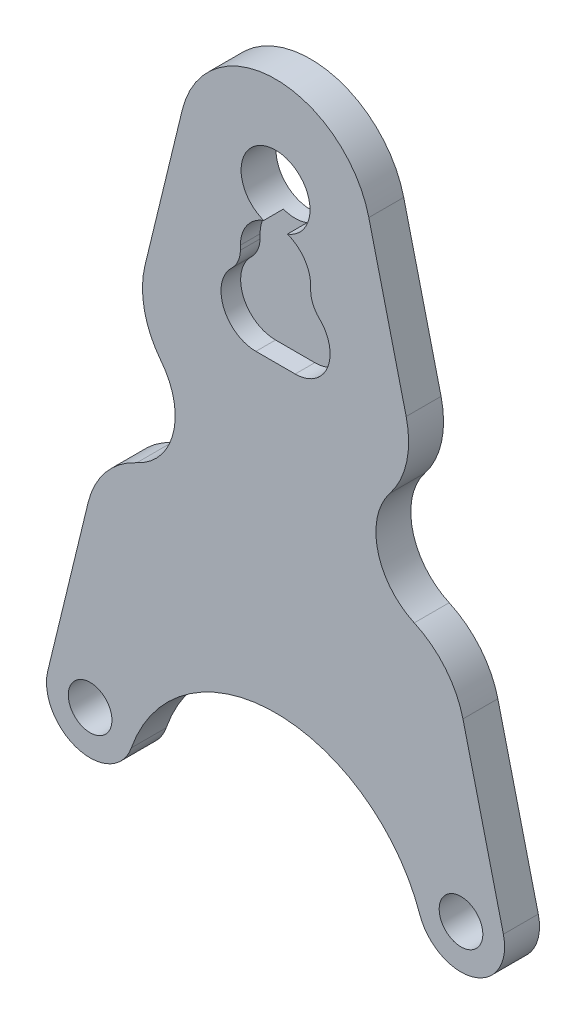
ISO-10303-21;
HEADER;
FILE_DESCRIPTION(('STEP AP214'),'2;1');
FILE_NAME('part.step','',(''),(''),'','','');
FILE_SCHEMA(('AUTOMOTIVE_DESIGN { 1 0 10303 214 1 1 1 1 }'));
ENDSEC;
DATA;
#1=APPLICATION_CONTEXT('core data for automotive mechanical design processes');
#2=APPLICATION_PROTOCOL_DEFINITION('international standard','automotive_design',2000,#1);
#3=PRODUCT_CONTEXT('',#1,'mechanical');
#4=PRODUCT('Part','Part','',(#3));
#5=PRODUCT_RELATED_PRODUCT_CATEGORY('part','',(#4));
#6=PRODUCT_DEFINITION_FORMATION('','',#4);
#7=PRODUCT_DEFINITION_CONTEXT('part definition',#1,'design');
#8=PRODUCT_DEFINITION('design','',#6,#7);
#9=PRODUCT_DEFINITION_SHAPE('','',#8);
#10=(LENGTH_UNIT() NAMED_UNIT(*) SI_UNIT(.MILLI.,.METRE.));
#11=(NAMED_UNIT(*) PLANE_ANGLE_UNIT() SI_UNIT($,.RADIAN.));
#12=(NAMED_UNIT(*) SI_UNIT($,.STERADIAN.) SOLID_ANGLE_UNIT());
#13=UNCERTAINTY_MEASURE_WITH_UNIT(LENGTH_MEASURE(1.E-05),#10,'distance_accuracy_value','');
#14=(GEOMETRIC_REPRESENTATION_CONTEXT(3) GLOBAL_UNCERTAINTY_ASSIGNED_CONTEXT((#13)) GLOBAL_UNIT_ASSIGNED_CONTEXT((#10,
#11,#12)) REPRESENTATION_CONTEXT('',''));
#15=CARTESIAN_POINT('',(0.,0.,0.));
#16=DIRECTION('',(0.,0.,1.));
#17=DIRECTION('',(1.,0.,0.));
#18=AXIS2_PLACEMENT_3D('',#15,#16,#17);
#19=CARTESIAN_POINT('',(21.3771541585496,5.19781493337387,8.));
#20=DIRECTION('',(-0.971688825388619,-0.236264315153357,0.));
#21=DIRECTION('',(0.236264315153358,-0.97168882538862,0.));
#22=AXIS2_PLACEMENT_3D('',#19,#20,#21);
#23=PLANE('',#22);
#24=DIRECTION('',(-0.236264315153357,0.97168882538862,0.));
#25=VECTOR('',#24,1.);
#26=CARTESIAN_POINT('',(21.3771541585496,5.19781493337387,0.));
#27=LINE('',#26,#25);
#28=CARTESIAN_POINT('',(52.2168882538862,-121.637356848466,0.));
#29=VERTEX_POINT('',#28);
#30=CARTESIAN_POINT('',(42.9509504695302,-83.5291550408393,0.));
#31=VERTEX_POINT('',#30);
#32=EDGE_CURVE('E326',#29,#31,#27,.T.);
#33=ORIENTED_EDGE('',*,*,#32,.T.);
#34=DIRECTION('',(0.,0.,1.));
#35=VECTOR('',#34,1.);
#36=CARTESIAN_POINT('',(42.9509504695302,-83.5291550408393,8.));
#37=LINE('',#36,#35);
#38=CARTESIAN_POINT('',(42.9509504695302,-83.5291550408393,8.));
#39=VERTEX_POINT('',#38);
#40=EDGE_CURVE('E361',#31,#39,#37,.T.);
#41=ORIENTED_EDGE('',*,*,#40,.T.);
#42=DIRECTION('',(-0.236264315153357,0.97168882538862,0.));
#43=VECTOR('',#42,1.);
#44=CARTESIAN_POINT('',(21.3771541585496,5.19781493337387,8.));
#45=LINE('',#44,#43);
#46=CARTESIAN_POINT('',(52.2168882538862,-121.637356848466,8.));
#47=VERTEX_POINT('',#46);
#48=EDGE_CURVE('E309',#47,#39,#45,.T.);
#49=ORIENTED_EDGE('',*,*,#48,.F.);
#50=DIRECTION('',(0.,0.,-1.));
#51=VECTOR('',#50,1.);
#52=CARTESIAN_POINT('',(52.2168882538862,-121.637356848466,8.));
#53=LINE('',#52,#51);
#54=EDGE_CURVE('E347',#47,#29,#53,.T.);
#55=ORIENTED_EDGE('',*,*,#54,.T.);
#56=EDGE_LOOP('',(#33,#41,#49,#55));
#57=FACE_BOUND('',#56,.T.);
#58=ADVANCED_FACE('F36',(#57),#23,.F.);
#59=CARTESIAN_POINT('',(-21.3771541585496,5.19781493337386,8.));
#60=DIRECTION('',(0.971688825388619,-0.236264315153357,0.));
#61=DIRECTION('',(0.236264315153357,0.97168882538862,0.));
#62=AXIS2_PLACEMENT_3D('',#59,#60,#61);
#63=PLANE('',#62);
#64=DIRECTION('',(-0.236264315153357,-0.97168882538862,0.));
#65=VECTOR('',#64,1.);
#66=CARTESIAN_POINT('',(-21.3771541585496,5.19781493337386,0.));
#67=LINE('',#66,#65);
#68=CARTESIAN_POINT('',(-21.3771541585496,5.19781493337386,0.));
#69=VERTEX_POINT('',#68);
#70=CARTESIAN_POINT('',(-29.9379372507617,-30.0102835129736,0.));
#71=VERTEX_POINT('',#70);
#72=EDGE_CURVE('E332',#69,#71,#67,.T.);
#73=ORIENTED_EDGE('',*,*,#72,.T.);
#74=DIRECTION('',(0.,0.,1.));
#75=VECTOR('',#74,1.);
#76=CARTESIAN_POINT('',(-29.9379372507617,-30.0102835129736,8.));
#77=LINE('',#76,#75);
#78=CARTESIAN_POINT('',(-29.9379372507617,-30.0102835129736,8.));
#79=VERTEX_POINT('',#78);
#80=EDGE_CURVE('E11',#71,#79,#77,.T.);
#81=ORIENTED_EDGE('',*,*,#80,.T.);
#82=DIRECTION('',(-0.236264315153357,-0.97168882538862,0.));
#83=VECTOR('',#82,1.);
#84=CARTESIAN_POINT('',(-21.3771541585496,5.19781493337386,8.));
#85=LINE('',#84,#83);
#86=CARTESIAN_POINT('',(-21.3771541585496,5.19781493337386,8.));
#87=VERTEX_POINT('',#86);
#88=EDGE_CURVE('E315',#87,#79,#85,.T.);
#89=ORIENTED_EDGE('',*,*,#88,.F.);
#90=DIRECTION('',(0.,0.,-1.));
#91=VECTOR('',#90,1.);
#92=CARTESIAN_POINT('',(-21.3771541585496,5.19781493337386,8.));
#93=LINE('',#92,#91);
#94=EDGE_CURVE('E341',#87,#69,#93,.T.);
#95=ORIENTED_EDGE('',*,*,#94,.T.);
#96=EDGE_LOOP('',(#73,#81,#89,#95));
#97=FACE_BOUND('',#96,.T.);
#98=ADVANCED_FACE('F445',(#97),#63,.F.);
#99=CARTESIAN_POINT('',(0.,-138.790199457749,8.));
#100=DIRECTION('',(0.,0.,-1.));
#101=DIRECTION('',(-1.,0.,0.));
#102=AXIS2_PLACEMENT_3D('',#99,#100,#101);
#103=PLANE('',#102);
#104=ORIENTED_EDGE('',*,*,#48,.T.);
#105=CARTESIAN_POINT('',(23.5171739617578,-88.2544413439064,8.));
#106=DIRECTION('',(0.,0.,-1.));
#107=DIRECTION('',(-1.,0.,0.));
#108=AXIS2_PLACEMENT_3D('',#105,#106,#107);
#109=CIRCLE('',#108,20.);
#110=CARTESIAN_POINT('',(31.793074555039,-70.047039844238,8.));
#111=VERTEX_POINT('',#110);
#112=EDGE_CURVE('E370',#39,#111,#109,.F.);
#113=ORIENTED_EDGE('',*,*,#112,.T.);
#114=CARTESIAN_POINT('',(38.,-56.3914887194867,8.));
#115=DIRECTION('',(0.,0.,1.));
#116=DIRECTION('',(-1.,0.,0.));
#117=AXIS2_PLACEMENT_3D('',#114,#115,#116);
#118=CIRCLE('',#117,15.);
#119=CARTESIAN_POINT('',(26.2160688898526,-47.1103806180099,8.));
#120=VERTEX_POINT('',#119);
#121=EDGE_CURVE('E230',#120,#111,#118,.T.);
#122=ORIENTED_EDGE('',*,*,#121,.F.);
#123=CARTESIAN_POINT('',(10.5041607429893,-34.7355698160408,8.));
#124=DIRECTION('',(0.,0.,-1.));
#125=DIRECTION('',(-1.,0.,0.));
#126=AXIS2_PLACEMENT_3D('',#123,#124,#125);
#127=CIRCLE('',#126,20.);
#128=CARTESIAN_POINT('',(29.9379372507617,-30.0102835129736,8.));
#129=VERTEX_POINT('',#128);
#130=EDGE_CURVE('E368',#120,#129,#127,.F.);
#131=ORIENTED_EDGE('',*,*,#130,.T.);
#132=CARTESIAN_POINT('',(21.3771541585496,5.19781493337387,8.));
#133=VERTEX_POINT('',#132);
#134=EDGE_CURVE('E308',#129,#133,#45,.T.);
#135=ORIENTED_EDGE('',*,*,#134,.T.);
#136=CARTESIAN_POINT('',(0.,0.,8.));
#137=DIRECTION('',(0.,0.,1.));
#138=DIRECTION('',(-1.,0.,0.));
#139=AXIS2_PLACEMENT_3D('',#136,#137,#138);
#140=CIRCLE('',#139,22.);
#141=EDGE_CURVE('E312',#133,#87,#140,.T.);
#142=ORIENTED_EDGE('',*,*,#141,.T.);
#143=ORIENTED_EDGE('',*,*,#88,.T.);
#144=CARTESIAN_POINT('',(-10.5041607429893,-34.7355698160408,8.));
#145=DIRECTION('',(0.,0.,-1.));
#146=DIRECTION('',(-1.,0.,0.));
#147=AXIS2_PLACEMENT_3D('',#144,#145,#146);
#148=CIRCLE('',#147,20.);
#149=CARTESIAN_POINT('',(-26.2160688898526,-47.1103806180099,8.));
#150=VERTEX_POINT('',#149);
#151=EDGE_CURVE('E364',#79,#150,#148,.F.);
#152=ORIENTED_EDGE('',*,*,#151,.T.);
#153=CARTESIAN_POINT('',(-38.,-56.3914887194868,8.));
#154=DIRECTION('',(0.,0.,1.));
#155=DIRECTION('',(1.,0.,0.));
#156=AXIS2_PLACEMENT_3D('',#153,#154,#155);
#157=CIRCLE('',#156,15.);
#158=CARTESIAN_POINT('',(-31.793074555039,-70.047039844238,8.));
#159=VERTEX_POINT('',#158);
#160=EDGE_CURVE('E392',#159,#150,#157,.T.);
#161=ORIENTED_EDGE('',*,*,#160,.F.);
#162=CARTESIAN_POINT('',(-23.5171739617577,-88.2544413439064,8.));
#163=DIRECTION('',(0.,0.,-1.));
#164=DIRECTION('',(-1.,0.,0.));
#165=AXIS2_PLACEMENT_3D('',#162,#163,#164);
#166=CIRCLE('',#165,20.);
#167=CARTESIAN_POINT('',(-42.9509504695301,-83.5291550408393,8.));
#168=VERTEX_POINT('',#167);
#169=EDGE_CURVE('E366',#159,#168,#166,.F.);
#170=ORIENTED_EDGE('',*,*,#169,.T.);
#171=CARTESIAN_POINT('',(-52.2168882538862,-121.637356848466,8.));
#172=VERTEX_POINT('',#171);
#173=EDGE_CURVE('E314',#168,#172,#85,.T.);
#174=ORIENTED_EDGE('',*,*,#173,.T.);
#175=CARTESIAN_POINT('',(-42.5,-124.,8.));
#176=DIRECTION('',(0.,0.,1.));
#177=DIRECTION('',(1.,0.,0.));
#178=AXIS2_PLACEMENT_3D('',#175,#176,#177);
#179=CIRCLE('',#178,10.);
#180=CARTESIAN_POINT('',(-33.0555555555555,-127.286710990611,8.));
#181=VERTEX_POINT('',#180);
#182=EDGE_CURVE('E318',#172,#181,#179,.T.);
#183=ORIENTED_EDGE('',*,*,#182,.T.);
#184=CARTESIAN_POINT('',(0.,-138.790199457749,8.));
#185=DIRECTION('',(0.,0.,-1.));
#186=DIRECTION('',(-1.,0.,0.));
#187=AXIS2_PLACEMENT_3D('',#184,#185,#186);
#188=CIRCLE('',#187,35.);
#189=CARTESIAN_POINT('',(33.0555555555556,-127.286710990611,8.));
#190=VERTEX_POINT('',#189);
#191=EDGE_CURVE('E302',#181,#190,#188,.T.);
#192=ORIENTED_EDGE('',*,*,#191,.T.);
#193=CARTESIAN_POINT('',(42.5,-124.,8.));
#194=DIRECTION('',(0.,0.,1.));
#195=DIRECTION('',(-1.,0.,0.));
#196=AXIS2_PLACEMENT_3D('',#193,#194,#195);
#197=CIRCLE('',#196,10.);
#198=EDGE_CURVE('E305',#190,#47,#197,.T.);
#199=ORIENTED_EDGE('',*,*,#198,.T.);
#200=EDGE_LOOP('',(#104,#113,#122,#131,#135,#142,#143,#152,#161,#170,#174,#183,#192,#199));
#201=FACE_BOUND('',#200,.T.);
#202=DIRECTION('',(0.,-1.,0.));
#203=VECTOR('',#202,1.);
#204=CARTESIAN_POINT('',(-8.05,-16.0000000000001,8.));
#205=LINE('',#204,#203);
#206=CARTESIAN_POINT('',(-8.05,-15.,8.));
#207=VERTEX_POINT('',#206);
#208=CARTESIAN_POINT('',(-8.05,-16.0000000000001,8.));
#209=VERTEX_POINT('',#208);
#210=EDGE_CURVE('E255',#207,#209,#205,.T.);
#211=ORIENTED_EDGE('',*,*,#210,.F.);
#212=CARTESIAN_POINT('',(0.,-15.,8.));
#213=DIRECTION('',(0.,0.,1.));
#214=DIRECTION('',(-1.,0.,0.));
#215=AXIS2_PLACEMENT_3D('',#212,#213,#214);
#216=CIRCLE('',#215,8.05);
#217=CARTESIAN_POINT('',(-2.71106804368685,-7.42025,8.));
#218=VERTEX_POINT('',#217);
#219=EDGE_CURVE('E252',#218,#207,#216,.T.);
#220=ORIENTED_EDGE('',*,*,#219,.F.);
#221=CARTESIAN_POINT('',(0.,0.,8.));
#222=DIRECTION('',(0.,0.,1.));
#223=DIRECTION('',(1.,0.,0.));
#224=AXIS2_PLACEMENT_3D('',#221,#222,#223);
#225=CIRCLE('',#224,7.9);
#226=CARTESIAN_POINT('',(2.71106804368685,-7.42025,8.));
#227=VERTEX_POINT('',#226);
#228=EDGE_CURVE('E295',#227,#218,#225,.T.);
#229=ORIENTED_EDGE('',*,*,#228,.F.);
#230=CARTESIAN_POINT('',(8.05,-15.,8.));
#231=VERTEX_POINT('',#230);
#232=EDGE_CURVE('E253',#231,#227,#216,.T.);
#233=ORIENTED_EDGE('',*,*,#232,.F.);
#234=DIRECTION('',(0.,1.,0.));
#235=VECTOR('',#234,1.);
#236=CARTESIAN_POINT('',(8.05,-16.,8.));
#237=LINE('',#236,#235);
#238=CARTESIAN_POINT('',(8.05,-16.,8.));
#239=VERTEX_POINT('',#238);
#240=EDGE_CURVE('E249',#239,#231,#237,.T.);
#241=ORIENTED_EDGE('',*,*,#240,.F.);
#242=CARTESIAN_POINT('',(14.4986462662698,-15.8678586645881,8.));
#243=DIRECTION('',(0.,0.,-1.));
#244=DIRECTION('',(1.,0.,0.));
#245=AXIS2_PLACEMENT_3D('',#242,#243,#244);
#246=CIRCLE('',#245,6.45);
#247=CARTESIAN_POINT('',(10.0355827079694,-20.5244200219173,8.));
#248=VERTEX_POINT('',#247);
#249=EDGE_CURVE('E206',#248,#239,#246,.T.);
#250=ORIENTED_EDGE('',*,*,#249,.F.);
#251=CARTESIAN_POINT('',(4.5,-26.3,8.));
#252=DIRECTION('',(0.,0.,1.));
#253=DIRECTION('',(-1.,0.,0.));
#254=AXIS2_PLACEMENT_3D('',#251,#252,#253);
#255=CIRCLE('',#254,8.);
#256=CARTESIAN_POINT('',(4.5,-34.3,8.));
#257=VERTEX_POINT('',#256);
#258=EDGE_CURVE('E223',#257,#248,#255,.T.);
#259=ORIENTED_EDGE('',*,*,#258,.F.);
#260=DIRECTION('',(1.,0.,0.));
#261=VECTOR('',#260,1.);
#262=CARTESIAN_POINT('',(4.5,-34.3,8.));
#263=LINE('',#262,#261);
#264=CARTESIAN_POINT('',(-4.5,-34.3,8.));
#265=VERTEX_POINT('',#264);
#266=EDGE_CURVE('E227',#265,#257,#263,.T.);
#267=ORIENTED_EDGE('',*,*,#266,.F.);
#268=CARTESIAN_POINT('',(-4.49999999999999,-26.3,8.));
#269=DIRECTION('',(0.,0.,1.));
#270=DIRECTION('',(1.,0.,0.));
#271=AXIS2_PLACEMENT_3D('',#268,#269,#270);
#272=CIRCLE('',#271,8.);
#273=CARTESIAN_POINT('',(-10.0355827079694,-20.5244200219173,8.));
#274=VERTEX_POINT('',#273);
#275=EDGE_CURVE('E262',#274,#265,#272,.T.);
#276=ORIENTED_EDGE('',*,*,#275,.F.);
#277=CARTESIAN_POINT('',(-14.4986462662698,-15.8678586645882,8.));
#278=DIRECTION('',(0.,0.,-1.));
#279=DIRECTION('',(-1.,0.,0.));
#280=AXIS2_PLACEMENT_3D('',#277,#278,#279);
#281=CIRCLE('',#280,6.45);
#282=EDGE_CURVE('E258',#209,#274,#281,.T.);
#283=ORIENTED_EDGE('',*,*,#282,.F.);
#284=EDGE_LOOP('',(#211,#220,#229,#233,#241,#250,#259,#267,#276,#283));
#285=FACE_BOUND('',#284,.T.);
#286=CARTESIAN_POINT('',(-42.5,-124.,8.));
#287=DIRECTION('',(0.,0.,1.));
#288=DIRECTION('',(1.,0.,0.));
#289=AXIS2_PLACEMENT_3D('',#286,#287,#288);
#290=CIRCLE('',#289,5.00000000000001);
#291=CARTESIAN_POINT('',(-37.5,-124.,8.));
#292=VERTEX_POINT('',#291);
#293=EDGE_CURVE('E289',#292,#292,#290,.T.);
#294=ORIENTED_EDGE('',*,*,#293,.F.);
#295=EDGE_LOOP('',(#294));
#296=FACE_BOUND('',#295,.T.);
#297=CARTESIAN_POINT('',(42.5,-124.,8.));
#298=DIRECTION('',(0.,0.,1.));
#299=DIRECTION('',(-1.,0.,0.));
#300=AXIS2_PLACEMENT_3D('',#297,#298,#299);
#301=CIRCLE('',#300,5.);
#302=CARTESIAN_POINT('',(37.5,-124.,8.));
#303=VERTEX_POINT('',#302);
#304=EDGE_CURVE('E283',#303,#303,#301,.T.);
#305=ORIENTED_EDGE('',*,*,#304,.F.);
#306=EDGE_LOOP('',(#305));
#307=FACE_BOUND('',#306,.T.);
#308=ADVANCED_FACE('F397',(#201,#285,#296,#307),#103,.F.);
#309=CARTESIAN_POINT('',(0.,-138.790199457749,0.));
#310=DIRECTION('',(0.,0.,-1.));
#311=DIRECTION('',(-1.,0.,0.));
#312=AXIS2_PLACEMENT_3D('',#309,#310,#311);
#313=PLANE('',#312);
#314=CARTESIAN_POINT('',(38.,-56.3914887194867,0.));
#315=DIRECTION('',(0.,0.,1.));
#316=DIRECTION('',(-1.,0.,0.));
#317=AXIS2_PLACEMENT_3D('',#314,#315,#316);
#318=CIRCLE('',#317,15.);
#319=CARTESIAN_POINT('',(26.2160688898526,-47.1103806180099,0.));
#320=VERTEX_POINT('',#319);
#321=CARTESIAN_POINT('',(31.793074555039,-70.047039844238,0.));
#322=VERTEX_POINT('',#321);
#323=EDGE_CURVE('E400',#320,#322,#318,.T.);
#324=ORIENTED_EDGE('',*,*,#323,.T.);
#325=CARTESIAN_POINT('',(23.5171739617578,-88.2544413439064,0.));
#326=DIRECTION('',(0.,0.,-1.));
#327=DIRECTION('',(-1.,0.,0.));
#328=AXIS2_PLACEMENT_3D('',#325,#326,#327);
#329=CIRCLE('',#328,20.);
#330=EDGE_CURVE('E380',#322,#31,#329,.T.);
#331=ORIENTED_EDGE('',*,*,#330,.T.);
#332=ORIENTED_EDGE('',*,*,#32,.F.);
#333=CARTESIAN_POINT('',(42.5,-124.,0.));
#334=DIRECTION('',(0.,0.,1.));
#335=DIRECTION('',(-1.,0.,0.));
#336=AXIS2_PLACEMENT_3D('',#333,#334,#335);
#337=CIRCLE('',#336,10.);
#338=CARTESIAN_POINT('',(33.0555555555556,-127.286710990611,0.));
#339=VERTEX_POINT('',#338);
#340=EDGE_CURVE('E323',#339,#29,#337,.T.);
#341=ORIENTED_EDGE('',*,*,#340,.F.);
#342=CARTESIAN_POINT('',(0.,-138.790199457749,0.));
#343=DIRECTION('',(0.,0.,-1.));
#344=DIRECTION('',(-1.,0.,0.));
#345=AXIS2_PLACEMENT_3D('',#342,#343,#344);
#346=CIRCLE('',#345,35.);
#347=CARTESIAN_POINT('',(-33.0555555555555,-127.286710990611,0.));
#348=VERTEX_POINT('',#347);
#349=EDGE_CURVE('E299',#348,#339,#346,.T.);
#350=ORIENTED_EDGE('',*,*,#349,.F.);
#351=CARTESIAN_POINT('',(-42.5,-124.,0.));
#352=DIRECTION('',(0.,0.,1.));
#353=DIRECTION('',(1.,0.,0.));
#354=AXIS2_PLACEMENT_3D('',#351,#352,#353);
#355=CIRCLE('',#354,10.);
#356=CARTESIAN_POINT('',(-52.2168882538862,-121.637356848466,0.));
#357=VERTEX_POINT('',#356);
#358=EDGE_CURVE('E306',#357,#348,#355,.T.);
#359=ORIENTED_EDGE('',*,*,#358,.F.);
#360=CARTESIAN_POINT('',(-42.9509504695301,-83.5291550408393,0.));
#361=VERTEX_POINT('',#360);
#362=EDGE_CURVE('E331',#361,#357,#67,.T.);
#363=ORIENTED_EDGE('',*,*,#362,.F.);
#364=CARTESIAN_POINT('',(-23.5171739617577,-88.2544413439064,0.));
#365=DIRECTION('',(0.,0.,-1.));
#366=DIRECTION('',(-1.,0.,0.));
#367=AXIS2_PLACEMENT_3D('',#364,#365,#366);
#368=CIRCLE('',#367,20.);
#369=CARTESIAN_POINT('',(-31.793074555039,-70.047039844238,0.));
#370=VERTEX_POINT('',#369);
#371=EDGE_CURVE('E51',#361,#370,#368,.T.);
#372=ORIENTED_EDGE('',*,*,#371,.T.);
#373=CARTESIAN_POINT('',(-38.,-56.3914887194868,0.));
#374=DIRECTION('',(0.,0.,1.));
#375=DIRECTION('',(1.,0.,0.));
#376=AXIS2_PLACEMENT_3D('',#373,#374,#375);
#377=CIRCLE('',#376,15.);
#378=CARTESIAN_POINT('',(-26.2160688898526,-47.1103806180099,0.));
#379=VERTEX_POINT('',#378);
#380=EDGE_CURVE('E250',#370,#379,#377,.T.);
#381=ORIENTED_EDGE('',*,*,#380,.T.);
#382=CARTESIAN_POINT('',(-10.5041607429893,-34.7355698160408,0.));
#383=DIRECTION('',(0.,0.,-1.));
#384=DIRECTION('',(-1.,0.,0.));
#385=AXIS2_PLACEMENT_3D('',#382,#383,#384);
#386=CIRCLE('',#385,20.);
#387=EDGE_CURVE('E376',#379,#71,#386,.T.);
#388=ORIENTED_EDGE('',*,*,#387,.T.);
#389=ORIENTED_EDGE('',*,*,#72,.F.);
#390=CARTESIAN_POINT('',(0.,0.,0.));
#391=DIRECTION('',(0.,0.,1.));
#392=DIRECTION('',(-1.,0.,0.));
#393=AXIS2_PLACEMENT_3D('',#390,#391,#392);
#394=CIRCLE('',#393,22.);
#395=CARTESIAN_POINT('',(21.3771541585496,5.19781493337387,0.));
#396=VERTEX_POINT('',#395);
#397=EDGE_CURVE('E329',#396,#69,#394,.T.);
#398=ORIENTED_EDGE('',*,*,#397,.F.);
#399=CARTESIAN_POINT('',(29.9379372507617,-30.0102835129736,0.));
#400=VERTEX_POINT('',#399);
#401=EDGE_CURVE('E325',#400,#396,#27,.T.);
#402=ORIENTED_EDGE('',*,*,#401,.F.);
#403=CARTESIAN_POINT('',(10.5041607429893,-34.7355698160408,0.));
#404=DIRECTION('',(0.,0.,-1.));
#405=DIRECTION('',(-1.,0.,0.));
#406=AXIS2_PLACEMENT_3D('',#403,#404,#405);
#407=CIRCLE('',#406,20.);
#408=EDGE_CURVE('E59',#400,#320,#407,.T.);
#409=ORIENTED_EDGE('',*,*,#408,.T.);
#410=EDGE_LOOP('',(#324,#331,#332,#341,#350,#359,#363,#372,#381,#388,#389,#398,#402,#409));
#411=FACE_BOUND('',#410,.T.);
#412=CARTESIAN_POINT('',(-42.5,-124.,0.));
#413=DIRECTION('',(0.,0.,1.));
#414=DIRECTION('',(1.,0.,0.));
#415=AXIS2_PLACEMENT_3D('',#412,#413,#414);
#416=CIRCLE('',#415,5.00000000000001);
#417=CARTESIAN_POINT('',(-37.5,-124.,0.));
#418=VERTEX_POINT('',#417);
#419=EDGE_CURVE('E286',#418,#418,#416,.T.);
#420=ORIENTED_EDGE('',*,*,#419,.T.);
#421=EDGE_LOOP('',(#420));
#422=FACE_BOUND('',#421,.T.);
#423=CARTESIAN_POINT('',(0.,0.,0.));
#424=DIRECTION('',(0.,0.,1.));
#425=DIRECTION('',(1.,0.,0.));
#426=AXIS2_PLACEMENT_3D('',#423,#424,#425);
#427=CIRCLE('',#426,7.9);
#428=CARTESIAN_POINT('',(7.9,0.,0.));
#429=VERTEX_POINT('',#428);
#430=EDGE_CURVE('E292',#429,#429,#427,.T.);
#431=ORIENTED_EDGE('',*,*,#430,.T.);
#432=EDGE_LOOP('',(#431));
#433=FACE_BOUND('',#432,.T.);
#434=CARTESIAN_POINT('',(42.5,-124.,0.));
#435=DIRECTION('',(0.,0.,1.));
#436=DIRECTION('',(-1.,0.,0.));
#437=AXIS2_PLACEMENT_3D('',#434,#435,#436);
#438=CIRCLE('',#437,5.);
#439=CARTESIAN_POINT('',(37.5,-124.,0.));
#440=VERTEX_POINT('',#439);
#441=EDGE_CURVE('E270',#440,#440,#438,.T.);
#442=ORIENTED_EDGE('',*,*,#441,.T.);
#443=EDGE_LOOP('',(#442));
#444=FACE_BOUND('',#443,.T.);
#445=ADVANCED_FACE('F410',(#411,#422,#433,#444),#313,.T.);
#446=CARTESIAN_POINT('',(0.,-138.790199457749,8.));
#447=DIRECTION('',(0.,0.,-1.));
#448=DIRECTION('',(-1.,0.,0.));
#449=AXIS2_PLACEMENT_3D('',#446,#447,#448);
#450=CYLINDRICAL_SURFACE('',#449,35.);
#451=ORIENTED_EDGE('',*,*,#349,.T.);
#452=DIRECTION('',(0.,0.,-1.));
#453=VECTOR('',#452,1.);
#454=CARTESIAN_POINT('',(33.0555555555556,-127.286710990611,8.));
#455=LINE('',#454,#453);
#456=EDGE_CURVE('E350',#190,#339,#455,.T.);
#457=ORIENTED_EDGE('',*,*,#456,.F.);
#458=ORIENTED_EDGE('',*,*,#191,.F.);
#459=DIRECTION('',(0.,0.,-1.));
#460=VECTOR('',#459,1.);
#461=CARTESIAN_POINT('',(-33.0555555555555,-127.286710990611,8.));
#462=LINE('',#461,#460);
#463=EDGE_CURVE('E320',#181,#348,#462,.T.);
#464=ORIENTED_EDGE('',*,*,#463,.T.);
#465=EDGE_LOOP('',(#451,#457,#458,#464));
#466=FACE_BOUND('',#465,.T.);
#467=ADVANCED_FACE('F419',(#466),#450,.F.);
#468=CARTESIAN_POINT('',(42.5,-124.,8.));
#469=DIRECTION('',(0.,0.,-1.));
#470=DIRECTION('',(-1.,0.,0.));
#471=AXIS2_PLACEMENT_3D('',#468,#469,#470);
#472=CYLINDRICAL_SURFACE('',#471,10.);
#473=ORIENTED_EDGE('',*,*,#340,.T.);
#474=ORIENTED_EDGE('',*,*,#54,.F.);
#475=ORIENTED_EDGE('',*,*,#198,.F.);
#476=ORIENTED_EDGE('',*,*,#456,.T.);
#477=EDGE_LOOP('',(#473,#474,#475,#476));
#478=FACE_BOUND('',#477,.T.);
#479=ADVANCED_FACE('F424',(#478),#472,.T.);
#480=ORIENTED_EDGE('',*,*,#134,.F.);
#481=DIRECTION('',(0.,0.,1.));
#482=VECTOR('',#481,1.);
#483=CARTESIAN_POINT('',(29.9379372507617,-30.0102835129736,8.));
#484=LINE('',#483,#482);
#485=EDGE_CURVE('E382',#129,#400,#484,.F.);
#486=ORIENTED_EDGE('',*,*,#485,.T.);
#487=ORIENTED_EDGE('',*,*,#401,.T.);
#488=DIRECTION('',(0.,0.,-1.));
#489=VECTOR('',#488,1.);
#490=CARTESIAN_POINT('',(21.3771541585496,5.19781493337387,8.));
#491=LINE('',#490,#489);
#492=EDGE_CURVE('E344',#133,#396,#491,.T.);
#493=ORIENTED_EDGE('',*,*,#492,.F.);
#494=EDGE_LOOP('',(#480,#486,#487,#493));
#495=FACE_BOUND('',#494,.T.);
#496=ADVANCED_FACE('F455',(#495),#23,.F.);
#497=CARTESIAN_POINT('',(0.,0.,8.));
#498=DIRECTION('',(0.,0.,-1.));
#499=DIRECTION('',(-1.,0.,0.));
#500=AXIS2_PLACEMENT_3D('',#497,#498,#499);
#501=CYLINDRICAL_SURFACE('',#500,22.);
#502=ORIENTED_EDGE('',*,*,#397,.T.);
#503=ORIENTED_EDGE('',*,*,#94,.F.);
#504=ORIENTED_EDGE('',*,*,#141,.F.);
#505=ORIENTED_EDGE('',*,*,#492,.T.);
#506=EDGE_LOOP('',(#502,#503,#504,#505));
#507=FACE_BOUND('',#506,.T.);
#508=ADVANCED_FACE('F451',(#507),#501,.T.);
#509=ORIENTED_EDGE('',*,*,#173,.F.);
#510=DIRECTION('',(0.,0.,1.));
#511=VECTOR('',#510,1.);
#512=CARTESIAN_POINT('',(-42.9509504695301,-83.5291550408393,8.));
#513=LINE('',#512,#511);
#514=EDGE_CURVE('E384',#168,#361,#513,.F.);
#515=ORIENTED_EDGE('',*,*,#514,.T.);
#516=ORIENTED_EDGE('',*,*,#362,.T.);
#517=DIRECTION('',(0.,0.,-1.));
#518=VECTOR('',#517,1.);
#519=CARTESIAN_POINT('',(-52.2168882538862,-121.637356848466,8.));
#520=LINE('',#519,#518);
#521=EDGE_CURVE('E338',#172,#357,#520,.T.);
#522=ORIENTED_EDGE('',*,*,#521,.F.);
#523=EDGE_LOOP('',(#509,#515,#516,#522));
#524=FACE_BOUND('',#523,.T.);
#525=ADVANCED_FACE('F405',(#524),#63,.F.);
#526=CARTESIAN_POINT('',(-42.5,-124.,8.));
#527=DIRECTION('',(0.,0.,-1.));
#528=DIRECTION('',(-1.,0.,0.));
#529=AXIS2_PLACEMENT_3D('',#526,#527,#528);
#530=CYLINDRICAL_SURFACE('',#529,10.);
#531=ORIENTED_EDGE('',*,*,#358,.T.);
#532=ORIENTED_EDGE('',*,*,#463,.F.);
#533=ORIENTED_EDGE('',*,*,#182,.F.);
#534=ORIENTED_EDGE('',*,*,#521,.T.);
#535=EDGE_LOOP('',(#531,#532,#533,#534));
#536=FACE_BOUND('',#535,.T.);
#537=ADVANCED_FACE('F415',(#536),#530,.T.);
#538=CARTESIAN_POINT('',(0.,0.,8.));
#539=DIRECTION('',(0.,0.,-1.));
#540=DIRECTION('',(-1.,0.,0.));
#541=AXIS2_PLACEMENT_3D('',#538,#539,#540);
#542=CYLINDRICAL_SURFACE('',#541,7.9);
#543=DIRECTION('',(0.,0.,1.));
#544=VECTOR('',#543,1.);
#545=CARTESIAN_POINT('',(-2.71106804368685,-7.42025,5.75));
#546=LINE('',#545,#544);
#547=CARTESIAN_POINT('',(-2.71106804368685,-7.42025,3.5));
#548=VERTEX_POINT('',#547);
#549=EDGE_CURVE('E359',#548,#218,#546,.T.);
#550=ORIENTED_EDGE('',*,*,#549,.F.);
#551=CARTESIAN_POINT('',(0.,0.,3.5));
#552=DIRECTION('',(0.,0.,1.));
#553=DIRECTION('',(1.,0.,0.));
#554=AXIS2_PLACEMENT_3D('',#551,#552,#553);
#555=CIRCLE('',#554,7.9);
#556=CARTESIAN_POINT('',(2.71106804368685,-7.42025,3.5));
#557=VERTEX_POINT('',#556);
#558=EDGE_CURVE('E353',#548,#557,#555,.T.);
#559=ORIENTED_EDGE('',*,*,#558,.T.);
#560=DIRECTION('',(0.,0.,1.));
#561=VECTOR('',#560,1.);
#562=CARTESIAN_POINT('',(2.71106804368685,-7.42025,5.75));
#563=LINE('',#562,#561);
#564=EDGE_CURVE('E356',#227,#557,#563,.F.);
#565=ORIENTED_EDGE('',*,*,#564,.F.);
#566=ORIENTED_EDGE('',*,*,#228,.T.);
#567=EDGE_LOOP('',(#550,#559,#565,#566));
#568=FACE_BOUND('',#567,.T.);
#569=ORIENTED_EDGE('',*,*,#430,.F.);
#570=EDGE_LOOP('',(#569));
#571=FACE_BOUND('',#570,.T.);
#572=ADVANCED_FACE('F492',(#568,#571),#542,.F.);
#573=CARTESIAN_POINT('',(-42.5,-124.,8.));
#574=DIRECTION('',(0.,0.,-1.));
#575=DIRECTION('',(-1.,0.,0.));
#576=AXIS2_PLACEMENT_3D('',#573,#574,#575);
#577=CYLINDRICAL_SURFACE('',#576,5.00000000000001);
#578=ORIENTED_EDGE('',*,*,#293,.T.);
#579=EDGE_LOOP('',(#578));
#580=FACE_BOUND('',#579,.T.);
#581=ORIENTED_EDGE('',*,*,#419,.F.);
#582=EDGE_LOOP('',(#581));
#583=FACE_BOUND('',#582,.T.);
#584=ADVANCED_FACE('F510',(#580,#583),#577,.F.);
#585=CARTESIAN_POINT('',(42.5,-124.,8.));
#586=DIRECTION('',(0.,0.,-1.));
#587=DIRECTION('',(-1.,0.,0.));
#588=AXIS2_PLACEMENT_3D('',#585,#586,#587);
#589=CYLINDRICAL_SURFACE('',#588,5.);
#590=ORIENTED_EDGE('',*,*,#304,.T.);
#591=EDGE_LOOP('',(#590));
#592=FACE_BOUND('',#591,.T.);
#593=ORIENTED_EDGE('',*,*,#441,.F.);
#594=EDGE_LOOP('',(#593));
#595=FACE_BOUND('',#594,.T.);
#596=ADVANCED_FACE('F518',(#592,#595),#589,.F.);
#597=CARTESIAN_POINT('',(0.,-15.,3.5));
#598=DIRECTION('',(0.,0.,1.));
#599=DIRECTION('',(1.,0.,0.));
#600=AXIS2_PLACEMENT_3D('',#597,#598,#599);
#601=CYLINDRICAL_SURFACE('',#600,8.05);
#602=ORIENTED_EDGE('',*,*,#549,.T.);
#603=ORIENTED_EDGE('',*,*,#219,.T.);
#604=DIRECTION('',(0.,0.,1.));
#605=VECTOR('',#604,1.);
#606=CARTESIAN_POINT('',(-8.05,-15.,3.5));
#607=LINE('',#606,#605);
#608=CARTESIAN_POINT('',(-8.05,-15.,3.5));
#609=VERTEX_POINT('',#608);
#610=EDGE_CURVE('E279',#609,#207,#607,.T.);
#611=ORIENTED_EDGE('',*,*,#610,.F.);
#612=CARTESIAN_POINT('',(0.,-15.,3.5));
#613=DIRECTION('',(0.,0.,1.));
#614=DIRECTION('',(-1.,0.,0.));
#615=AXIS2_PLACEMENT_3D('',#612,#613,#614);
#616=CIRCLE('',#615,8.05);
#617=EDGE_CURVE('E218',#548,#609,#616,.T.);
#618=ORIENTED_EDGE('',*,*,#617,.F.);
#619=EDGE_LOOP('',(#602,#603,#611,#618));
#620=FACE_BOUND('',#619,.T.);
#621=ADVANCED_FACE('F525',(#620),#601,.F.);
#622=CARTESIAN_POINT('',(14.4986462662698,-15.8678586645881,3.5));
#623=DIRECTION('',(0.,0.,1.));
#624=DIRECTION('',(1.,0.,0.));
#625=AXIS2_PLACEMENT_3D('',#622,#623,#624);
#626=CYLINDRICAL_SURFACE('',#625,6.45);
#627=ORIENTED_EDGE('',*,*,#249,.T.);
#628=DIRECTION('',(0.,0.,1.));
#629=VECTOR('',#628,1.);
#630=CARTESIAN_POINT('',(8.05,-16.,3.5));
#631=LINE('',#630,#629);
#632=CARTESIAN_POINT('',(8.05,-16.,3.5));
#633=VERTEX_POINT('',#632);
#634=EDGE_CURVE('E199',#633,#239,#631,.T.);
#635=ORIENTED_EDGE('',*,*,#634,.F.);
#636=CARTESIAN_POINT('',(14.4986462662698,-15.8678586645881,3.5));
#637=DIRECTION('',(0.,0.,-1.));
#638=DIRECTION('',(1.,0.,0.));
#639=AXIS2_PLACEMENT_3D('',#636,#637,#638);
#640=CIRCLE('',#639,6.45);
#641=CARTESIAN_POINT('',(10.0355827079694,-20.5244200219173,3.5));
#642=VERTEX_POINT('',#641);
#643=EDGE_CURVE('E203',#642,#633,#640,.T.);
#644=ORIENTED_EDGE('',*,*,#643,.F.);
#645=DIRECTION('',(0.,0.,1.));
#646=VECTOR('',#645,1.);
#647=CARTESIAN_POINT('',(10.0355827079694,-20.5244200219173,3.5));
#648=LINE('',#647,#646);
#649=EDGE_CURVE('E268',#642,#248,#648,.T.);
#650=ORIENTED_EDGE('',*,*,#649,.T.);
#651=EDGE_LOOP('',(#627,#635,#644,#650));
#652=FACE_BOUND('',#651,.T.);
#653=ADVANCED_FACE('F201',(#652),#626,.T.);
#654=CARTESIAN_POINT('',(4.5,-26.3,3.5));
#655=DIRECTION('',(0.,0.,1.));
#656=DIRECTION('',(1.,0.,0.));
#657=AXIS2_PLACEMENT_3D('',#654,#655,#656);
#658=CYLINDRICAL_SURFACE('',#657,8.);
#659=ORIENTED_EDGE('',*,*,#258,.T.);
#660=ORIENTED_EDGE('',*,*,#649,.F.);
#661=CARTESIAN_POINT('',(4.5,-26.3,3.5));
#662=DIRECTION('',(0.,0.,1.));
#663=DIRECTION('',(-1.,0.,0.));
#664=AXIS2_PLACEMENT_3D('',#661,#662,#663);
#665=CIRCLE('',#664,8.);
#666=CARTESIAN_POINT('',(4.5,-34.3,3.5));
#667=VERTEX_POINT('',#666);
#668=EDGE_CURVE('E211',#667,#642,#665,.T.);
#669=ORIENTED_EDGE('',*,*,#668,.F.);
#670=DIRECTION('',(0.,0.,1.));
#671=VECTOR('',#670,1.);
#672=CARTESIAN_POINT('',(4.5,-34.3,3.5));
#673=LINE('',#672,#671);
#674=EDGE_CURVE('E271',#667,#257,#673,.T.);
#675=ORIENTED_EDGE('',*,*,#674,.T.);
#676=EDGE_LOOP('',(#659,#660,#669,#675));
#677=FACE_BOUND('',#676,.T.);
#678=ADVANCED_FACE('F543',(#677),#658,.F.);
#679=CARTESIAN_POINT('',(4.5,-34.3,3.5));
#680=DIRECTION('',(0.,-1.,0.));
#681=DIRECTION('',(0.,0.,-1.));
#682=AXIS2_PLACEMENT_3D('',#679,#680,#681);
#683=PLANE('',#682);
#684=ORIENTED_EDGE('',*,*,#266,.T.);
#685=ORIENTED_EDGE('',*,*,#674,.F.);
#686=DIRECTION('',(1.,0.,0.));
#687=VECTOR('',#686,1.);
#688=CARTESIAN_POINT('',(4.5,-34.3,3.5));
#689=LINE('',#688,#687);
#690=CARTESIAN_POINT('',(-4.5,-34.3,3.5));
#691=VERTEX_POINT('',#690);
#692=EDGE_CURVE('E244',#691,#667,#689,.T.);
#693=ORIENTED_EDGE('',*,*,#692,.F.);
#694=DIRECTION('',(0.,0.,1.));
#695=VECTOR('',#694,1.);
#696=CARTESIAN_POINT('',(-4.5,-34.3,3.5));
#697=LINE('',#696,#695);
#698=EDGE_CURVE('E273',#691,#265,#697,.T.);
#699=ORIENTED_EDGE('',*,*,#698,.T.);
#700=EDGE_LOOP('',(#684,#685,#693,#699));
#701=FACE_BOUND('',#700,.T.);
#702=ADVANCED_FACE('F550',(#701),#683,.F.);
#703=CARTESIAN_POINT('',(-4.49999999999999,-26.3,3.5));
#704=DIRECTION('',(0.,0.,1.));
#705=DIRECTION('',(1.,0.,0.));
#706=AXIS2_PLACEMENT_3D('',#703,#704,#705);
#707=CYLINDRICAL_SURFACE('',#706,8.);
#708=ORIENTED_EDGE('',*,*,#275,.T.);
#709=ORIENTED_EDGE('',*,*,#698,.F.);
#710=CARTESIAN_POINT('',(-4.49999999999999,-26.3,3.5));
#711=DIRECTION('',(0.,0.,1.));
#712=DIRECTION('',(1.,0.,0.));
#713=AXIS2_PLACEMENT_3D('',#710,#711,#712);
#714=CIRCLE('',#713,8.);
#715=CARTESIAN_POINT('',(-10.0355827079694,-20.5244200219173,3.5));
#716=VERTEX_POINT('',#715);
#717=EDGE_CURVE('E241',#716,#691,#714,.T.);
#718=ORIENTED_EDGE('',*,*,#717,.F.);
#719=DIRECTION('',(0.,0.,1.));
#720=VECTOR('',#719,1.);
#721=CARTESIAN_POINT('',(-10.0355827079694,-20.5244200219173,3.5));
#722=LINE('',#721,#720);
#723=EDGE_CURVE('E275',#716,#274,#722,.T.);
#724=ORIENTED_EDGE('',*,*,#723,.T.);
#725=EDGE_LOOP('',(#708,#709,#718,#724));
#726=FACE_BOUND('',#725,.T.);
#727=ADVANCED_FACE('F558',(#726),#707,.F.);
#728=CARTESIAN_POINT('',(-14.4986462662698,-15.8678586645882,3.5));
#729=DIRECTION('',(0.,0.,1.));
#730=DIRECTION('',(1.,0.,0.));
#731=AXIS2_PLACEMENT_3D('',#728,#729,#730);
#732=CYLINDRICAL_SURFACE('',#731,6.45);
#733=ORIENTED_EDGE('',*,*,#282,.T.);
#734=ORIENTED_EDGE('',*,*,#723,.F.);
#735=CARTESIAN_POINT('',(-14.4986462662698,-15.8678586645882,3.5));
#736=DIRECTION('',(0.,0.,-1.));
#737=DIRECTION('',(-1.,0.,0.));
#738=AXIS2_PLACEMENT_3D('',#735,#736,#737);
#739=CIRCLE('',#738,6.45);
#740=CARTESIAN_POINT('',(-8.05,-16.0000000000001,3.5));
#741=VERTEX_POINT('',#740);
#742=EDGE_CURVE('E238',#741,#716,#739,.T.);
#743=ORIENTED_EDGE('',*,*,#742,.F.);
#744=DIRECTION('',(0.,0.,1.));
#745=VECTOR('',#744,1.);
#746=CARTESIAN_POINT('',(-8.05,-16.0000000000001,3.5));
#747=LINE('',#746,#745);
#748=EDGE_CURVE('E277',#741,#209,#747,.T.);
#749=ORIENTED_EDGE('',*,*,#748,.T.);
#750=EDGE_LOOP('',(#733,#734,#743,#749));
#751=FACE_BOUND('',#750,.T.);
#752=ADVANCED_FACE('F565',(#751),#732,.T.);
#753=CARTESIAN_POINT('',(-8.05,-16.0000000000001,3.5));
#754=DIRECTION('',(-1.,0.,0.));
#755=DIRECTION('',(0.,0.,1.));
#756=AXIS2_PLACEMENT_3D('',#753,#754,#755);
#757=PLANE('',#756);
#758=ORIENTED_EDGE('',*,*,#210,.T.);
#759=ORIENTED_EDGE('',*,*,#748,.F.);
#760=DIRECTION('',(0.,-1.,0.));
#761=VECTOR('',#760,1.);
#762=CARTESIAN_POINT('',(-8.05,-16.0000000000001,3.5));
#763=LINE('',#762,#761);
#764=EDGE_CURVE('E235',#609,#741,#763,.T.);
#765=ORIENTED_EDGE('',*,*,#764,.F.);
#766=ORIENTED_EDGE('',*,*,#610,.T.);
#767=EDGE_LOOP('',(#758,#759,#765,#766));
#768=FACE_BOUND('',#767,.T.);
#769=ADVANCED_FACE('F572',(#768),#757,.F.);
#770=ORIENTED_EDGE('',*,*,#564,.T.);
#771=CARTESIAN_POINT('',(8.05,-15.,3.5));
#772=VERTEX_POINT('',#771);
#773=EDGE_CURVE('E233',#772,#557,#616,.T.);
#774=ORIENTED_EDGE('',*,*,#773,.F.);
#775=DIRECTION('',(0.,0.,1.));
#776=VECTOR('',#775,1.);
#777=CARTESIAN_POINT('',(8.05,-15.,3.5));
#778=LINE('',#777,#776);
#779=EDGE_CURVE('E210',#772,#231,#778,.T.);
#780=ORIENTED_EDGE('',*,*,#779,.T.);
#781=ORIENTED_EDGE('',*,*,#232,.T.);
#782=EDGE_LOOP('',(#770,#774,#780,#781));
#783=FACE_BOUND('',#782,.T.);
#784=ADVANCED_FACE('F536',(#783),#601,.F.);
#785=CARTESIAN_POINT('',(8.05,-16.,3.5));
#786=DIRECTION('',(1.,0.,0.));
#787=DIRECTION('',(0.,1.,0.));
#788=AXIS2_PLACEMENT_3D('',#785,#786,#787);
#789=PLANE('',#788);
#790=ORIENTED_EDGE('',*,*,#240,.T.);
#791=ORIENTED_EDGE('',*,*,#779,.F.);
#792=DIRECTION('',(0.,1.,0.));
#793=VECTOR('',#792,1.);
#794=CARTESIAN_POINT('',(8.05,-16.,3.5));
#795=LINE('',#794,#793);
#796=EDGE_CURVE('E214',#633,#772,#795,.T.);
#797=ORIENTED_EDGE('',*,*,#796,.F.);
#798=ORIENTED_EDGE('',*,*,#634,.T.);
#799=EDGE_LOOP('',(#790,#791,#797,#798));
#800=FACE_BOUND('',#799,.T.);
#801=ADVANCED_FACE('F215',(#800),#789,.F.);
#802=CARTESIAN_POINT('',(14.4986462662698,-15.8678586645881,3.5));
#803=DIRECTION('',(0.,0.,1.));
#804=DIRECTION('',(1.,0.,0.));
#805=AXIS2_PLACEMENT_3D('',#802,#803,#804);
#806=PLANE('',#805);
#807=ORIENTED_EDGE('',*,*,#617,.T.);
#808=ORIENTED_EDGE('',*,*,#764,.T.);
#809=ORIENTED_EDGE('',*,*,#742,.T.);
#810=ORIENTED_EDGE('',*,*,#717,.T.);
#811=ORIENTED_EDGE('',*,*,#692,.T.);
#812=ORIENTED_EDGE('',*,*,#668,.T.);
#813=ORIENTED_EDGE('',*,*,#643,.T.);
#814=ORIENTED_EDGE('',*,*,#796,.T.);
#815=ORIENTED_EDGE('',*,*,#773,.T.);
#816=ORIENTED_EDGE('',*,*,#558,.F.);
#817=EDGE_LOOP('',(#807,#808,#809,#810,#811,#812,#813,#814,#815,#816));
#818=FACE_BOUND('',#817,.T.);
#819=ADVANCED_FACE('F220',(#818),#806,.T.);
#820=CARTESIAN_POINT('',(-38.,-56.3914887194868,0.));
#821=DIRECTION('',(0.,0.,1.));
#822=DIRECTION('',(1.,0.,0.));
#823=AXIS2_PLACEMENT_3D('',#820,#821,#822);
#824=CYLINDRICAL_SURFACE('',#823,15.);
#825=ORIENTED_EDGE('',*,*,#380,.F.);
#826=DIRECTION('',(0.,0.,1.));
#827=VECTOR('',#826,1.);
#828=CARTESIAN_POINT('',(-31.793074555039,-70.047039844238,0.));
#829=LINE('',#828,#827);
#830=EDGE_CURVE('E44',#370,#159,#829,.T.);
#831=ORIENTED_EDGE('',*,*,#830,.T.);
#832=ORIENTED_EDGE('',*,*,#160,.T.);
#833=DIRECTION('',(0.,0.,1.));
#834=VECTOR('',#833,1.);
#835=CARTESIAN_POINT('',(-26.2160688898526,-47.1103806180099,0.));
#836=LINE('',#835,#834);
#837=EDGE_CURVE('E386',#150,#379,#836,.F.);
#838=ORIENTED_EDGE('',*,*,#837,.T.);
#839=EDGE_LOOP('',(#825,#831,#832,#838));
#840=FACE_BOUND('',#839,.T.);
#841=ADVANCED_FACE('F391',(#840),#824,.F.);
#842=CARTESIAN_POINT('',(38.,-56.3914887194867,0.));
#843=DIRECTION('',(0.,0.,1.));
#844=DIRECTION('',(1.,0.,0.));
#845=AXIS2_PLACEMENT_3D('',#842,#843,#844);
#846=CYLINDRICAL_SURFACE('',#845,15.);
#847=ORIENTED_EDGE('',*,*,#121,.T.);
#848=DIRECTION('',(0.,0.,1.));
#849=VECTOR('',#848,1.);
#850=CARTESIAN_POINT('',(31.793074555039,-70.047039844238,0.));
#851=LINE('',#850,#849);
#852=EDGE_CURVE('E374',#111,#322,#851,.F.);
#853=ORIENTED_EDGE('',*,*,#852,.T.);
#854=ORIENTED_EDGE('',*,*,#323,.F.);
#855=DIRECTION('',(0.,0.,1.));
#856=VECTOR('',#855,1.);
#857=CARTESIAN_POINT('',(26.2160688898526,-47.1103806180099,0.));
#858=LINE('',#857,#856);
#859=EDGE_CURVE('E372',#320,#120,#858,.T.);
#860=ORIENTED_EDGE('',*,*,#859,.T.);
#861=EDGE_LOOP('',(#847,#853,#854,#860));
#862=FACE_BOUND('',#861,.T.);
#863=ADVANCED_FACE('F436',(#862),#846,.F.);
#864=CARTESIAN_POINT('',(23.5171739617578,-88.2544413439064,0.));
#865=DIRECTION('',(0.,0.,1.));
#866=DIRECTION('',(1.,0.,0.));
#867=AXIS2_PLACEMENT_3D('',#864,#865,#866);
#868=CYLINDRICAL_SURFACE('',#867,20.);
#869=ORIENTED_EDGE('',*,*,#330,.F.);
#870=ORIENTED_EDGE('',*,*,#852,.F.);
#871=ORIENTED_EDGE('',*,*,#112,.F.);
#872=ORIENTED_EDGE('',*,*,#40,.F.);
#873=EDGE_LOOP('',(#869,#870,#871,#872));
#874=FACE_BOUND('',#873,.T.);
#875=ADVANCED_FACE('F430',(#874),#868,.T.);
#876=CARTESIAN_POINT('',(10.5041607429893,-34.7355698160408,0.));
#877=DIRECTION('',(0.,0.,1.));
#878=DIRECTION('',(1.,0.,0.));
#879=AXIS2_PLACEMENT_3D('',#876,#877,#878);
#880=CYLINDRICAL_SURFACE('',#879,20.);
#881=ORIENTED_EDGE('',*,*,#130,.F.);
#882=ORIENTED_EDGE('',*,*,#859,.F.);
#883=ORIENTED_EDGE('',*,*,#408,.F.);
#884=ORIENTED_EDGE('',*,*,#485,.F.);
#885=EDGE_LOOP('',(#881,#882,#883,#884));
#886=FACE_BOUND('',#885,.T.);
#887=ADVANCED_FACE('F456',(#886),#880,.T.);
#888=CARTESIAN_POINT('',(-23.5171739617577,-88.2544413439064,0.));
#889=DIRECTION('',(0.,0.,1.));
#890=DIRECTION('',(1.,0.,0.));
#891=AXIS2_PLACEMENT_3D('',#888,#889,#890);
#892=CYLINDRICAL_SURFACE('',#891,20.);
#893=ORIENTED_EDGE('',*,*,#169,.F.);
#894=ORIENTED_EDGE('',*,*,#830,.F.);
#895=ORIENTED_EDGE('',*,*,#371,.F.);
#896=ORIENTED_EDGE('',*,*,#514,.F.);
#897=EDGE_LOOP('',(#893,#894,#895,#896));
#898=FACE_BOUND('',#897,.T.);
#899=ADVANCED_FACE('F402',(#898),#892,.T.);
#900=CARTESIAN_POINT('',(-10.5041607429893,-34.7355698160408,0.));
#901=DIRECTION('',(0.,0.,1.));
#902=DIRECTION('',(1.,0.,0.));
#903=AXIS2_PLACEMENT_3D('',#900,#901,#902);
#904=CYLINDRICAL_SURFACE('',#903,20.);
#905=ORIENTED_EDGE('',*,*,#387,.F.);
#906=ORIENTED_EDGE('',*,*,#837,.F.);
#907=ORIENTED_EDGE('',*,*,#151,.F.);
#908=ORIENTED_EDGE('',*,*,#80,.F.);
#909=EDGE_LOOP('',(#905,#906,#907,#908));
#910=FACE_BOUND('',#909,.T.);
#911=ADVANCED_FACE('F38',(#910),#904,.T.);
#912=CLOSED_SHELL('',(#58,#98,#308,#445,#467,#479,#496,#508,#525,#537,#572,#584,#596,#621,#653,
#678,#702,#727,#752,#769,#784,#801,#819,#841,#863,#875,#887,#899,#911));
#913=MANIFOLD_SOLID_BREP('B2',#912);
#914=ADVANCED_BREP_SHAPE_REPRESENTATION('',(#18,#913),#14);
#915=SHAPE_DEFINITION_REPRESENTATION(#9,#914);
ENDSEC;
END-ISO-10303-21;
